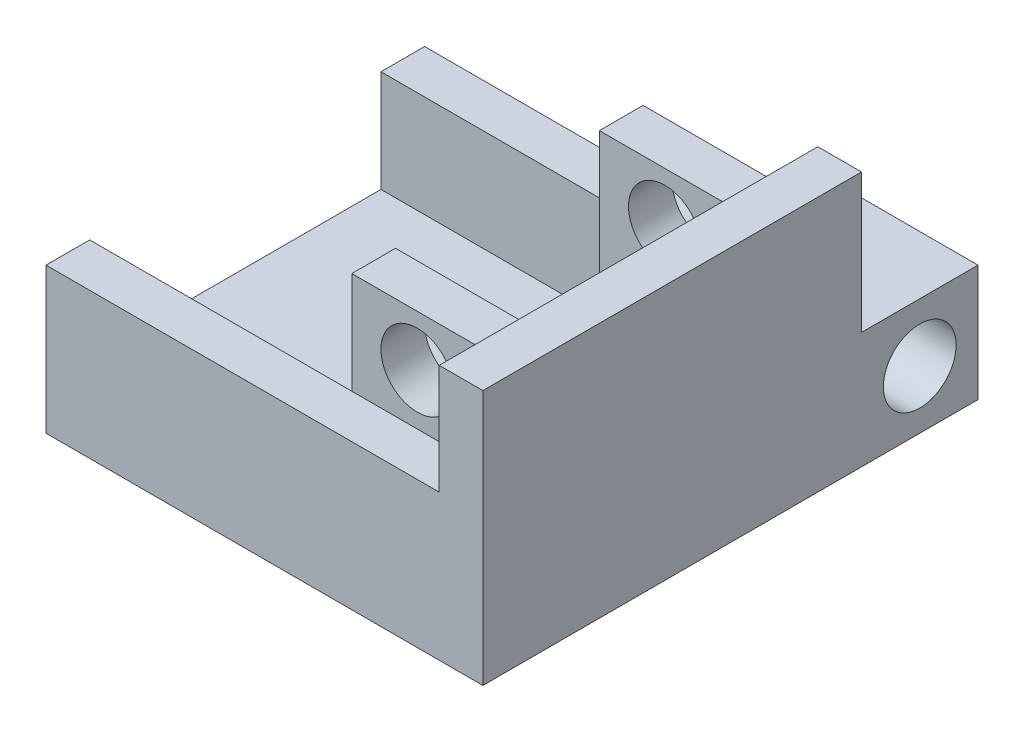
ISO-10303-21;
HEADER;
FILE_DESCRIPTION(('STEP AP214'),'2;1');
FILE_NAME('part.step','',(''),(''),'','','');
FILE_SCHEMA(('AUTOMOTIVE_DESIGN { 1 0 10303 214 1 1 1 1 }'));
ENDSEC;
DATA;
#1=APPLICATION_CONTEXT('core data for automotive mechanical design processes');
#2=APPLICATION_PROTOCOL_DEFINITION('international standard','automotive_design',2000,#1);
#3=PRODUCT_CONTEXT('',#1,'mechanical');
#4=PRODUCT('Part','Part','',(#3));
#5=PRODUCT_RELATED_PRODUCT_CATEGORY('part','',(#4));
#6=PRODUCT_DEFINITION_FORMATION('','',#4);
#7=PRODUCT_DEFINITION_CONTEXT('part definition',#1,'design');
#8=PRODUCT_DEFINITION('design','',#6,#7);
#9=PRODUCT_DEFINITION_SHAPE('','',#8);
#10=(LENGTH_UNIT() NAMED_UNIT(*) SI_UNIT(.MILLI.,.METRE.));
#11=(NAMED_UNIT(*) PLANE_ANGLE_UNIT() SI_UNIT($,.RADIAN.));
#12=(NAMED_UNIT(*) SI_UNIT($,.STERADIAN.) SOLID_ANGLE_UNIT());
#13=UNCERTAINTY_MEASURE_WITH_UNIT(LENGTH_MEASURE(1.E-05),#10,'distance_accuracy_value','');
#14=(GEOMETRIC_REPRESENTATION_CONTEXT(3) GLOBAL_UNCERTAINTY_ASSIGNED_CONTEXT((#13)) GLOBAL_UNIT_ASSIGNED_CONTEXT((#10,
#11,#12)) REPRESENTATION_CONTEXT('',''));
#15=CARTESIAN_POINT('',(0.,0.,0.));
#16=DIRECTION('',(0.,0.,1.));
#17=DIRECTION('',(1.,0.,0.));
#18=AXIS2_PLACEMENT_3D('',#15,#16,#17);
#19=CARTESIAN_POINT('',(0.,3.,-13.));
#20=DIRECTION('',(0.,0.,1.));
#21=DIRECTION('',(1.,0.,0.));
#22=AXIS2_PLACEMENT_3D('',#19,#20,#21);
#23=PLANE('',#22);
#24=DIRECTION('',(1.,0.,0.));
#25=VECTOR('',#24,1.);
#26=CARTESIAN_POINT('',(6.50000000000001,8.,-13.));
#27=LINE('',#26,#25);
#28=CARTESIAN_POINT('',(6.50000000000001,8.,-13.));
#29=VERTEX_POINT('',#28);
#30=CARTESIAN_POINT('',(16.5,8.,-13.));
#31=VERTEX_POINT('',#30);
#32=EDGE_CURVE('E254',#29,#31,#27,.T.);
#33=ORIENTED_EDGE('',*,*,#32,.F.);
#34=DIRECTION('',(0.,-1.,0.));
#35=VECTOR('',#34,1.);
#36=CARTESIAN_POINT('',(6.50000000000001,0.,-13.));
#37=LINE('',#36,#35);
#38=CARTESIAN_POINT('',(6.50000000000001,0.,-13.));
#39=VERTEX_POINT('',#38);
#40=EDGE_CURVE('E243',#29,#39,#37,.T.);
#41=ORIENTED_EDGE('',*,*,#40,.T.);
#42=DIRECTION('',(-1.,0.,0.));
#43=VECTOR('',#42,1.);
#44=CARTESIAN_POINT('',(0.,0.,-13.));
#45=LINE('',#44,#43);
#46=CARTESIAN_POINT('',(-13.5,0.,-13.));
#47=VERTEX_POINT('',#46);
#48=EDGE_CURVE('E242',#39,#47,#45,.T.);
#49=ORIENTED_EDGE('',*,*,#48,.T.);
#50=DIRECTION('',(0.,-1.,0.));
#51=VECTOR('',#50,1.);
#52=CARTESIAN_POINT('',(-13.5,36.1725046566048,-13.));
#53=LINE('',#52,#51);
#54=CARTESIAN_POINT('',(-13.5,10.,-13.));
#55=VERTEX_POINT('',#54);
#56=EDGE_CURVE('E328',#55,#47,#53,.T.);
#57=ORIENTED_EDGE('',*,*,#56,.F.);
#58=DIRECTION('',(-1.,0.,0.));
#59=VECTOR('',#58,1.);
#60=CARTESIAN_POINT('',(4.5,10.,-13.));
#61=LINE('',#60,#59);
#62=CARTESIAN_POINT('',(13.5,10.,-13.));
#63=VERTEX_POINT('',#62);
#64=EDGE_CURVE('E396',#63,#55,#61,.T.);
#65=ORIENTED_EDGE('',*,*,#64,.F.);
#66=DIRECTION('',(0.,-1.,0.));
#67=VECTOR('',#66,1.);
#68=CARTESIAN_POINT('',(13.5,17.54,-13.));
#69=LINE('',#68,#67);
#70=CARTESIAN_POINT('',(13.5,17.54,-13.));
#71=VERTEX_POINT('',#70);
#72=EDGE_CURVE('E319',#71,#63,#69,.T.);
#73=ORIENTED_EDGE('',*,*,#72,.F.);
#74=DIRECTION('',(-1.,0.,0.));
#75=VECTOR('',#74,1.);
#76=CARTESIAN_POINT('',(16.5,17.54,-13.));
#77=LINE('',#76,#75);
#78=CARTESIAN_POINT('',(16.5,17.54,-13.));
#79=VERTEX_POINT('',#78);
#80=EDGE_CURVE('E308',#79,#71,#77,.T.);
#81=ORIENTED_EDGE('',*,*,#80,.F.);
#82=DIRECTION('',(0.,-1.,0.));
#83=VECTOR('',#82,1.);
#84=CARTESIAN_POINT('',(16.5,36.1725046566048,-13.));
#85=LINE('',#84,#83);
#86=EDGE_CURVE('E352',#79,#31,#85,.T.);
#87=ORIENTED_EDGE('',*,*,#86,.T.);
#88=EDGE_LOOP('',(#33,#41,#49,#57,#65,#73,#81,#87));
#89=FACE_BOUND('',#88,.T.);
#90=ADVANCED_FACE('F35',(#89),#23,.F.);
#91=CARTESIAN_POINT('',(13.5,36.1725046566048,0.));
#92=DIRECTION('',(-1.,0.,0.));
#93=DIRECTION('',(0.,0.,1.));
#94=AXIS2_PLACEMENT_3D('',#91,#92,#93);
#95=PLANE('',#94);
#96=DIRECTION('',(0.,0.,-1.));
#97=VECTOR('',#96,1.);
#98=CARTESIAN_POINT('',(13.5,17.,7.));
#99=LINE('',#98,#97);
#100=CARTESIAN_POINT('',(13.5,17.,10.));
#101=VERTEX_POINT('',#100);
#102=CARTESIAN_POINT('',(13.5,17.,7.));
#103=VERTEX_POINT('',#102);
#104=EDGE_CURVE('E273',#101,#103,#99,.T.);
#105=ORIENTED_EDGE('',*,*,#104,.F.);
#106=DIRECTION('',(0.,-1.,0.));
#107=VECTOR('',#106,1.);
#108=CARTESIAN_POINT('',(13.5,17.,10.));
#109=LINE('',#108,#107);
#110=CARTESIAN_POINT('',(13.5,10.,10.));
#111=VERTEX_POINT('',#110);
#112=EDGE_CURVE('E278',#101,#111,#109,.T.);
#113=ORIENTED_EDGE('',*,*,#112,.T.);
#114=DIRECTION('',(0.,0.,1.));
#115=VECTOR('',#114,1.);
#116=CARTESIAN_POINT('',(13.5,10.,-13.));
#117=LINE('',#116,#115);
#118=CARTESIAN_POINT('',(13.5,10.,13.));
#119=VERTEX_POINT('',#118);
#120=EDGE_CURVE('E11',#111,#119,#117,.T.);
#121=ORIENTED_EDGE('',*,*,#120,.T.);
#122=DIRECTION('',(0.,-1.,0.));
#123=VECTOR('',#122,1.);
#124=CARTESIAN_POINT('',(13.5,17.54,13.));
#125=LINE('',#124,#123);
#126=CARTESIAN_POINT('',(13.5,17.54,13.));
#127=VERTEX_POINT('',#126);
#128=EDGE_CURVE('E314',#127,#119,#125,.T.);
#129=ORIENTED_EDGE('',*,*,#128,.F.);
#130=DIRECTION('',(0.,0.,1.));
#131=VECTOR('',#130,1.);
#132=CARTESIAN_POINT('',(13.5,17.54,-13.));
#133=LINE('',#132,#131);
#134=EDGE_CURVE('E310',#71,#127,#133,.T.);
#135=ORIENTED_EDGE('',*,*,#134,.F.);
#136=ORIENTED_EDGE('',*,*,#72,.T.);
#137=CARTESIAN_POINT('',(13.5,10.,-10.));
#138=VERTEX_POINT('',#137);
#139=EDGE_CURVE('E46',#63,#138,#117,.T.);
#140=ORIENTED_EDGE('',*,*,#139,.T.);
#141=DIRECTION('',(0.,-1.,0.));
#142=VECTOR('',#141,1.);
#143=CARTESIAN_POINT('',(13.5,17.,-10.));
#144=LINE('',#143,#142);
#145=CARTESIAN_POINT('',(13.5,17.,-10.));
#146=VERTEX_POINT('',#145);
#147=EDGE_CURVE('E302',#146,#138,#144,.T.);
#148=ORIENTED_EDGE('',*,*,#147,.F.);
#149=DIRECTION('',(0.,0.,-1.));
#150=VECTOR('',#149,1.);
#151=CARTESIAN_POINT('',(13.5,17.,-10.));
#152=LINE('',#151,#150);
#153=CARTESIAN_POINT('',(13.5,17.,-7.));
#154=VERTEX_POINT('',#153);
#155=EDGE_CURVE('E292',#154,#146,#152,.T.);
#156=ORIENTED_EDGE('',*,*,#155,.F.);
#157=DIRECTION('',(0.,-1.,0.));
#158=VECTOR('',#157,1.);
#159=CARTESIAN_POINT('',(13.5,10.,-7.));
#160=LINE('',#159,#158);
#161=CARTESIAN_POINT('',(13.5,7.,-7.));
#162=VERTEX_POINT('',#161);
#163=EDGE_CURVE('E398',#154,#162,#160,.T.);
#164=ORIENTED_EDGE('',*,*,#163,.T.);
#165=DIRECTION('',(0.,0.,-1.));
#166=VECTOR('',#165,1.);
#167=CARTESIAN_POINT('',(13.5,7.,-13.));
#168=LINE('',#167,#166);
#169=CARTESIAN_POINT('',(13.5,7.,-10.));
#170=VERTEX_POINT('',#169);
#171=EDGE_CURVE('E399',#162,#170,#168,.T.);
#172=ORIENTED_EDGE('',*,*,#171,.T.);
#173=DIRECTION('',(0.,-1.,0.));
#174=VECTOR('',#173,1.);
#175=CARTESIAN_POINT('',(13.5,7.,-10.));
#176=LINE('',#175,#174);
#177=CARTESIAN_POINT('',(13.5,5.,-10.));
#178=VERTEX_POINT('',#177);
#179=EDGE_CURVE('E427',#170,#178,#176,.T.);
#180=ORIENTED_EDGE('',*,*,#179,.T.);
#181=DIRECTION('',(0.,0.,-1.));
#182=VECTOR('',#181,1.);
#183=CARTESIAN_POINT('',(13.5,5.,0.));
#184=LINE('',#183,#182);
#185=CARTESIAN_POINT('',(13.5,5.,-7.));
#186=VERTEX_POINT('',#185);
#187=EDGE_CURVE('E364',#186,#178,#184,.T.);
#188=ORIENTED_EDGE('',*,*,#187,.F.);
#189=DIRECTION('',(0.,-1.,0.));
#190=VECTOR('',#189,1.);
#191=CARTESIAN_POINT('',(13.5,5.,-7.));
#192=LINE('',#191,#190);
#193=CARTESIAN_POINT('',(13.5,3.,-7.));
#194=VERTEX_POINT('',#193);
#195=EDGE_CURVE('E367',#186,#194,#192,.T.);
#196=ORIENTED_EDGE('',*,*,#195,.T.);
#197=DIRECTION('',(0.,0.,-1.));
#198=VECTOR('',#197,1.);
#199=CARTESIAN_POINT('',(13.5,3.,0.));
#200=LINE('',#199,#198);
#201=CARTESIAN_POINT('',(13.5,3.,7.));
#202=VERTEX_POINT('',#201);
#203=EDGE_CURVE('E440',#202,#194,#200,.T.);
#204=ORIENTED_EDGE('',*,*,#203,.F.);
#205=DIRECTION('',(0.,-1.,0.));
#206=VECTOR('',#205,1.);
#207=CARTESIAN_POINT('',(13.5,5.,7.));
#208=LINE('',#207,#206);
#209=CARTESIAN_POINT('',(13.5,5.,7.));
#210=VERTEX_POINT('',#209);
#211=EDGE_CURVE('E387',#210,#202,#208,.T.);
#212=ORIENTED_EDGE('',*,*,#211,.F.);
#213=DIRECTION('',(0.,0.,-1.));
#214=VECTOR('',#213,1.);
#215=CARTESIAN_POINT('',(13.5,5.,0.));
#216=LINE('',#215,#214);
#217=CARTESIAN_POINT('',(13.5,5.,10.));
#218=VERTEX_POINT('',#217);
#219=EDGE_CURVE('E385',#218,#210,#216,.T.);
#220=ORIENTED_EDGE('',*,*,#219,.F.);
#221=DIRECTION('',(0.,-1.,0.));
#222=VECTOR('',#221,1.);
#223=CARTESIAN_POINT('',(13.5,7.,10.));
#224=LINE('',#223,#222);
#225=CARTESIAN_POINT('',(13.5,7.,10.));
#226=VERTEX_POINT('',#225);
#227=EDGE_CURVE('E433',#226,#218,#224,.T.);
#228=ORIENTED_EDGE('',*,*,#227,.F.);
#229=DIRECTION('',(0.,0.,-1.));
#230=VECTOR('',#229,1.);
#231=CARTESIAN_POINT('',(13.5,7.,13.));
#232=LINE('',#231,#230);
#233=CARTESIAN_POINT('',(13.5,7.,7.));
#234=VERTEX_POINT('',#233);
#235=EDGE_CURVE('E418',#226,#234,#232,.T.);
#236=ORIENTED_EDGE('',*,*,#235,.T.);
#237=DIRECTION('',(0.,-1.,0.));
#238=VECTOR('',#237,1.);
#239=CARTESIAN_POINT('',(13.5,10.,7.));
#240=LINE('',#239,#238);
#241=EDGE_CURVE('E61',#103,#234,#240,.T.);
#242=ORIENTED_EDGE('',*,*,#241,.F.);
#243=EDGE_LOOP('',(#105,#113,#121,#129,#135,#136,#140,#148,#156,#164,#172,#180,#188,#196,#204,
#212,#220,#228,#236,#242));
#244=FACE_BOUND('',#243,.T.);
#245=ADVANCED_FACE('F469',(#244),#95,.T.);
#246=CARTESIAN_POINT('',(0.,10.,0.));
#247=DIRECTION('',(0.,-1.,0.));
#248=DIRECTION('',(0.,0.,-1.));
#249=AXIS2_PLACEMENT_3D('',#246,#247,#248);
#250=PLANE('',#249);
#251=DIRECTION('',(1.,0.,0.));
#252=VECTOR('',#251,1.);
#253=CARTESIAN_POINT('',(4.5,10.,10.));
#254=LINE('',#253,#252);
#255=CARTESIAN_POINT('',(4.5,10.,10.));
#256=VERTEX_POINT('',#255);
#257=EDGE_CURVE('E266',#256,#111,#254,.T.);
#258=ORIENTED_EDGE('',*,*,#257,.F.);
#259=DIRECTION('',(1.,0.,0.));
#260=VECTOR('',#259,1.);
#261=CARTESIAN_POINT('',(0.,10.,10.));
#262=LINE('',#261,#260);
#263=CARTESIAN_POINT('',(-13.5,10.,10.));
#264=VERTEX_POINT('',#263);
#265=EDGE_CURVE('E331',#264,#256,#262,.T.);
#266=ORIENTED_EDGE('',*,*,#265,.F.);
#267=DIRECTION('',(0.,0.,-1.));
#268=VECTOR('',#267,1.);
#269=CARTESIAN_POINT('',(-13.5,10.,0.));
#270=LINE('',#269,#268);
#271=CARTESIAN_POINT('',(-13.5,10.,13.));
#272=VERTEX_POINT('',#271);
#273=EDGE_CURVE('E339',#272,#264,#270,.T.);
#274=ORIENTED_EDGE('',*,*,#273,.F.);
#275=DIRECTION('',(1.,0.,0.));
#276=VECTOR('',#275,1.);
#277=CARTESIAN_POINT('',(4.5,10.,13.));
#278=LINE('',#277,#276);
#279=EDGE_CURVE('E411',#272,#119,#278,.T.);
#280=ORIENTED_EDGE('',*,*,#279,.T.);
#281=ORIENTED_EDGE('',*,*,#120,.F.);
#282=EDGE_LOOP('',(#258,#266,#274,#280,#281));
#283=FACE_BOUND('',#282,.T.);
#284=ADVANCED_FACE('F515',(#283),#250,.F.);
#285=DIRECTION('',(-1.,0.,0.));
#286=VECTOR('',#285,1.);
#287=CARTESIAN_POINT('',(4.5,10.,-10.));
#288=LINE('',#287,#286);
#289=CARTESIAN_POINT('',(4.5,10.,-10.));
#290=VERTEX_POINT('',#289);
#291=EDGE_CURVE('E285',#138,#290,#288,.T.);
#292=ORIENTED_EDGE('',*,*,#291,.F.);
#293=ORIENTED_EDGE('',*,*,#139,.F.);
#294=ORIENTED_EDGE('',*,*,#64,.T.);
#295=DIRECTION('',(0.,0.,1.));
#296=VECTOR('',#295,1.);
#297=CARTESIAN_POINT('',(-13.5,10.,0.));
#298=LINE('',#297,#296);
#299=CARTESIAN_POINT('',(-13.5,10.,-10.));
#300=VERTEX_POINT('',#299);
#301=EDGE_CURVE('E322',#55,#300,#298,.T.);
#302=ORIENTED_EDGE('',*,*,#301,.T.);
#303=DIRECTION('',(1.,0.,0.));
#304=VECTOR('',#303,1.);
#305=CARTESIAN_POINT('',(0.,10.,-10.));
#306=LINE('',#305,#304);
#307=EDGE_CURVE('E324',#300,#290,#306,.T.);
#308=ORIENTED_EDGE('',*,*,#307,.T.);
#309=EDGE_LOOP('',(#292,#293,#294,#302,#308));
#310=FACE_BOUND('',#309,.T.);
#311=ADVANCED_FACE('F484',(#310),#250,.F.);
#312=CARTESIAN_POINT('',(4.5,3.,0.));
#313=DIRECTION('',(1.,0.,0.));
#314=DIRECTION('',(0.,0.,-1.));
#315=AXIS2_PLACEMENT_3D('',#312,#313,#314);
#316=PLANE('',#315);
#317=DIRECTION('',(0.,-1.,0.));
#318=VECTOR('',#317,1.);
#319=CARTESIAN_POINT('',(4.5,36.1725046566048,-10.));
#320=LINE('',#319,#318);
#321=CARTESIAN_POINT('',(4.5,5.,-10.));
#322=VERTEX_POINT('',#321);
#323=CARTESIAN_POINT('',(4.5,3.,-10.));
#324=VERTEX_POINT('',#323);
#325=EDGE_CURVE('E327',#322,#324,#320,.T.);
#326=ORIENTED_EDGE('',*,*,#325,.T.);
#327=DIRECTION('',(0.,0.,1.));
#328=VECTOR('',#327,1.);
#329=CARTESIAN_POINT('',(4.50000000000001,3.,0.));
#330=LINE('',#329,#328);
#331=CARTESIAN_POINT('',(4.5,3.,-7.));
#332=VERTEX_POINT('',#331);
#333=EDGE_CURVE('E356',#324,#332,#330,.T.);
#334=ORIENTED_EDGE('',*,*,#333,.T.);
#335=DIRECTION('',(0.,-1.,0.));
#336=VECTOR('',#335,1.);
#337=CARTESIAN_POINT('',(4.5,5.,-7.));
#338=LINE('',#337,#336);
#339=CARTESIAN_POINT('',(4.5,5.,-7.));
#340=VERTEX_POINT('',#339);
#341=EDGE_CURVE('E374',#340,#332,#338,.T.);
#342=ORIENTED_EDGE('',*,*,#341,.F.);
#343=DIRECTION('',(0.,0.,1.));
#344=VECTOR('',#343,1.);
#345=CARTESIAN_POINT('',(4.50000000000001,5.,0.));
#346=LINE('',#345,#344);
#347=EDGE_CURVE('E359',#322,#340,#346,.T.);
#348=ORIENTED_EDGE('',*,*,#347,.F.);
#349=EDGE_LOOP('',(#326,#334,#342,#348));
#350=FACE_BOUND('',#349,.T.);
#351=ADVANCED_FACE('F462',(#350),#316,.F.);
#352=CARTESIAN_POINT('',(4.5,7.,-10.));
#353=VERTEX_POINT('',#352);
#354=EDGE_CURVE('E334',#290,#353,#320,.T.);
#355=ORIENTED_EDGE('',*,*,#354,.T.);
#356=DIRECTION('',(0.,0.,1.));
#357=VECTOR('',#356,1.);
#358=CARTESIAN_POINT('',(4.5,7.,-13.));
#359=LINE('',#358,#357);
#360=CARTESIAN_POINT('',(4.5,7.,-7.));
#361=VERTEX_POINT('',#360);
#362=EDGE_CURVE('E395',#353,#361,#359,.T.);
#363=ORIENTED_EDGE('',*,*,#362,.T.);
#364=DIRECTION('',(0.,-1.,0.));
#365=VECTOR('',#364,1.);
#366=CARTESIAN_POINT('',(4.5,10.,-7.));
#367=LINE('',#366,#365);
#368=CARTESIAN_POINT('',(4.5,17.,-7.));
#369=VERTEX_POINT('',#368);
#370=EDGE_CURVE('E407',#369,#361,#367,.T.);
#371=ORIENTED_EDGE('',*,*,#370,.F.);
#372=DIRECTION('',(0.,0.,1.));
#373=VECTOR('',#372,1.);
#374=CARTESIAN_POINT('',(4.5,17.,-10.));
#375=LINE('',#374,#373);
#376=CARTESIAN_POINT('',(4.5,17.,-10.));
#377=VERTEX_POINT('',#376);
#378=EDGE_CURVE('E286',#377,#369,#375,.T.);
#379=ORIENTED_EDGE('',*,*,#378,.F.);
#380=DIRECTION('',(0.,-1.,0.));
#381=VECTOR('',#380,1.);
#382=CARTESIAN_POINT('',(4.5,17.,-10.));
#383=LINE('',#382,#381);
#384=EDGE_CURVE('E297',#377,#290,#383,.T.);
#385=ORIENTED_EDGE('',*,*,#384,.T.);
#386=EDGE_LOOP('',(#355,#363,#371,#379,#385));
#387=FACE_BOUND('',#386,.T.);
#388=ADVANCED_FACE('F478',(#387),#316,.F.);
#389=CARTESIAN_POINT('',(4.50000000000001,3.,0.));
#390=DIRECTION('',(-1.,0.,0.));
#391=DIRECTION('',(0.,0.,1.));
#392=AXIS2_PLACEMENT_3D('',#389,#390,#391);
#393=PLANE('',#392);
#394=DIRECTION('',(0.,-1.,0.));
#395=VECTOR('',#394,1.);
#396=CARTESIAN_POINT('',(4.5,36.1725046566048,10.));
#397=LINE('',#396,#395);
#398=CARTESIAN_POINT('',(4.5,7.,10.));
#399=VERTEX_POINT('',#398);
#400=EDGE_CURVE('E346',#256,#399,#397,.T.);
#401=ORIENTED_EDGE('',*,*,#400,.F.);
#402=DIRECTION('',(0.,-1.,0.));
#403=VECTOR('',#402,1.);
#404=CARTESIAN_POINT('',(4.5,17.,10.));
#405=LINE('',#404,#403);
#406=CARTESIAN_POINT('',(4.5,17.,10.));
#407=VERTEX_POINT('',#406);
#408=EDGE_CURVE('E282',#407,#256,#405,.T.);
#409=ORIENTED_EDGE('',*,*,#408,.F.);
#410=DIRECTION('',(0.,0.,1.));
#411=VECTOR('',#410,1.);
#412=CARTESIAN_POINT('',(4.5,17.,7.));
#413=LINE('',#412,#411);
#414=CARTESIAN_POINT('',(4.5,17.,7.));
#415=VERTEX_POINT('',#414);
#416=EDGE_CURVE('E267',#415,#407,#413,.T.);
#417=ORIENTED_EDGE('',*,*,#416,.F.);
#418=DIRECTION('',(0.,-1.,0.));
#419=VECTOR('',#418,1.);
#420=CARTESIAN_POINT('',(4.5,10.,7.));
#421=LINE('',#420,#419);
#422=CARTESIAN_POINT('',(4.5,7.,7.));
#423=VERTEX_POINT('',#422);
#424=EDGE_CURVE('E414',#415,#423,#421,.T.);
#425=ORIENTED_EDGE('',*,*,#424,.T.);
#426=DIRECTION('',(0.,0.,1.));
#427=VECTOR('',#426,1.);
#428=CARTESIAN_POINT('',(4.5,7.,13.));
#429=LINE('',#428,#427);
#430=EDGE_CURVE('E410',#423,#399,#429,.T.);
#431=ORIENTED_EDGE('',*,*,#430,.T.);
#432=EDGE_LOOP('',(#401,#409,#417,#425,#431));
#433=FACE_BOUND('',#432,.T.);
#434=ADVANCED_FACE('F531',(#433),#393,.T.);
#435=CARTESIAN_POINT('',(0.,3.,0.));
#436=DIRECTION('',(0.,1.,0.));
#437=DIRECTION('',(0.,0.,1.));
#438=AXIS2_PLACEMENT_3D('',#435,#436,#437);
#439=PLANE('',#438);
#440=DIRECTION('',(1.,0.,0.));
#441=VECTOR('',#440,1.);
#442=CARTESIAN_POINT('',(0.,3.,-7.));
#443=LINE('',#442,#441);
#444=EDGE_CURVE('E362',#332,#194,#443,.T.);
#445=ORIENTED_EDGE('',*,*,#444,.F.);
#446=ORIENTED_EDGE('',*,*,#333,.F.);
#447=DIRECTION('',(1.,0.,0.));
#448=VECTOR('',#447,1.);
#449=CARTESIAN_POINT('',(0.,3.,-10.));
#450=LINE('',#449,#448);
#451=CARTESIAN_POINT('',(-13.5,3.,-10.));
#452=VERTEX_POINT('',#451);
#453=EDGE_CURVE('E443',#452,#324,#450,.T.);
#454=ORIENTED_EDGE('',*,*,#453,.F.);
#455=DIRECTION('',(0.,0.,-1.));
#456=VECTOR('',#455,1.);
#457=CARTESIAN_POINT('',(-13.5,3.,0.));
#458=LINE('',#457,#456);
#459=CARTESIAN_POINT('',(-13.5,3.,10.));
#460=VERTEX_POINT('',#459);
#461=EDGE_CURVE('E445',#460,#452,#458,.T.);
#462=ORIENTED_EDGE('',*,*,#461,.F.);
#463=DIRECTION('',(1.,0.,0.));
#464=VECTOR('',#463,1.);
#465=CARTESIAN_POINT('',(0.,3.,10.));
#466=LINE('',#465,#464);
#467=CARTESIAN_POINT('',(4.5,3.,10.));
#468=VERTEX_POINT('',#467);
#469=EDGE_CURVE('E437',#460,#468,#466,.T.);
#470=ORIENTED_EDGE('',*,*,#469,.T.);
#471=DIRECTION('',(0.,0.,1.));
#472=VECTOR('',#471,1.);
#473=CARTESIAN_POINT('',(4.5,3.,0.));
#474=LINE('',#473,#472);
#475=CARTESIAN_POINT('',(4.5,3.,7.));
#476=VERTEX_POINT('',#475);
#477=EDGE_CURVE('E382',#476,#468,#474,.T.);
#478=ORIENTED_EDGE('',*,*,#477,.F.);
#479=DIRECTION('',(-1.,0.,0.));
#480=VECTOR('',#479,1.);
#481=CARTESIAN_POINT('',(0.,3.,7.));
#482=LINE('',#481,#480);
#483=EDGE_CURVE('E377',#202,#476,#482,.T.);
#484=ORIENTED_EDGE('',*,*,#483,.F.);
#485=ORIENTED_EDGE('',*,*,#203,.T.);
#486=EDGE_LOOP('',(#445,#446,#454,#462,#470,#478,#484,#485));
#487=FACE_BOUND('',#486,.T.);
#488=ADVANCED_FACE('F529',(#487),#439,.T.);
#489=CARTESIAN_POINT('',(4.5,5.,10.));
#490=VERTEX_POINT('',#489);
#491=EDGE_CURVE('E338',#490,#468,#397,.T.);
#492=ORIENTED_EDGE('',*,*,#491,.F.);
#493=DIRECTION('',(0.,0.,1.));
#494=VECTOR('',#493,1.);
#495=CARTESIAN_POINT('',(4.5,5.,0.));
#496=LINE('',#495,#494);
#497=CARTESIAN_POINT('',(4.5,5.,7.));
#498=VERTEX_POINT('',#497);
#499=EDGE_CURVE('E381',#498,#490,#496,.T.);
#500=ORIENTED_EDGE('',*,*,#499,.F.);
#501=DIRECTION('',(0.,-1.,0.));
#502=VECTOR('',#501,1.);
#503=CARTESIAN_POINT('',(4.5,5.,7.));
#504=LINE('',#503,#502);
#505=EDGE_CURVE('E393',#498,#476,#504,.T.);
#506=ORIENTED_EDGE('',*,*,#505,.T.);
#507=ORIENTED_EDGE('',*,*,#477,.T.);
#508=EDGE_LOOP('',(#492,#500,#506,#507));
#509=FACE_BOUND('',#508,.T.);
#510=ADVANCED_FACE('F37',(#509),#393,.T.);
#511=CARTESIAN_POINT('',(0.,3.,13.));
#512=DIRECTION('',(0.,0.,1.));
#513=DIRECTION('',(1.,0.,0.));
#514=AXIS2_PLACEMENT_3D('',#511,#512,#513);
#515=PLANE('',#514);
#516=ORIENTED_EDGE('',*,*,#279,.F.);
#517=DIRECTION('',(0.,-1.,0.));
#518=VECTOR('',#517,1.);
#519=CARTESIAN_POINT('',(-13.5,36.1725046566048,13.));
#520=LINE('',#519,#518);
#521=CARTESIAN_POINT('',(-13.5,0.,13.));
#522=VERTEX_POINT('',#521);
#523=EDGE_CURVE('E343',#272,#522,#520,.T.);
#524=ORIENTED_EDGE('',*,*,#523,.T.);
#525=DIRECTION('',(-1.,0.,0.));
#526=VECTOR('',#525,1.);
#527=CARTESIAN_POINT('',(0.,0.,13.));
#528=LINE('',#527,#526);
#529=CARTESIAN_POINT('',(16.5,0.,13.));
#530=VERTEX_POINT('',#529);
#531=EDGE_CURVE('E436',#530,#522,#528,.T.);
#532=ORIENTED_EDGE('',*,*,#531,.F.);
#533=DIRECTION('',(0.,-1.,0.));
#534=VECTOR('',#533,1.);
#535=CARTESIAN_POINT('',(16.5,36.1725046566048,13.));
#536=LINE('',#535,#534);
#537=CARTESIAN_POINT('',(16.5,17.54,13.));
#538=VERTEX_POINT('',#537);
#539=EDGE_CURVE('E353',#538,#530,#536,.T.);
#540=ORIENTED_EDGE('',*,*,#539,.F.);
#541=DIRECTION('',(1.,0.,0.));
#542=VECTOR('',#541,1.);
#543=CARTESIAN_POINT('',(16.5,17.54,13.));
#544=LINE('',#543,#542);
#545=EDGE_CURVE('E312',#127,#538,#544,.T.);
#546=ORIENTED_EDGE('',*,*,#545,.F.);
#547=ORIENTED_EDGE('',*,*,#128,.T.);
#548=EDGE_LOOP('',(#516,#524,#532,#540,#546,#547));
#549=FACE_BOUND('',#548,.T.);
#550=ADVANCED_FACE('F520',(#549),#515,.T.);
#551=CARTESIAN_POINT('',(-13.5,3.,0.));
#552=DIRECTION('',(-1.,0.,0.));
#553=DIRECTION('',(0.,0.,1.));
#554=AXIS2_PLACEMENT_3D('',#551,#552,#553);
#555=PLANE('',#554);
#556=DIRECTION('',(0.,0.,-1.));
#557=VECTOR('',#556,1.);
#558=CARTESIAN_POINT('',(-13.5,0.,0.));
#559=LINE('',#558,#557);
#560=EDGE_CURVE('E441',#522,#47,#559,.T.);
#561=ORIENTED_EDGE('',*,*,#560,.F.);
#562=ORIENTED_EDGE('',*,*,#523,.F.);
#563=ORIENTED_EDGE('',*,*,#273,.T.);
#564=DIRECTION('',(0.,-1.,0.));
#565=VECTOR('',#564,1.);
#566=CARTESIAN_POINT('',(-13.5,36.1725046566048,10.));
#567=LINE('',#566,#565);
#568=EDGE_CURVE('E342',#264,#460,#567,.T.);
#569=ORIENTED_EDGE('',*,*,#568,.T.);
#570=ORIENTED_EDGE('',*,*,#461,.T.);
#571=DIRECTION('',(0.,-1.,0.));
#572=VECTOR('',#571,1.);
#573=CARTESIAN_POINT('',(-13.5,36.1725046566048,-10.));
#574=LINE('',#573,#572);
#575=EDGE_CURVE('E332',#300,#452,#574,.T.);
#576=ORIENTED_EDGE('',*,*,#575,.F.);
#577=ORIENTED_EDGE('',*,*,#301,.F.);
#578=ORIENTED_EDGE('',*,*,#56,.T.);
#579=EDGE_LOOP('',(#561,#562,#563,#569,#570,#576,#577,#578));
#580=FACE_BOUND('',#579,.T.);
#581=ADVANCED_FACE('F522',(#580),#555,.T.);
#582=CARTESIAN_POINT('',(0.,0.,0.));
#583=DIRECTION('',(0.,1.,0.));
#584=DIRECTION('',(0.,0.,1.));
#585=AXIS2_PLACEMENT_3D('',#582,#583,#584);
#586=PLANE('',#585);
#587=ORIENTED_EDGE('',*,*,#531,.T.);
#588=ORIENTED_EDGE('',*,*,#560,.T.);
#589=ORIENTED_EDGE('',*,*,#48,.F.);
#590=DIRECTION('',(0.,0.,-1.));
#591=VECTOR('',#590,1.);
#592=CARTESIAN_POINT('',(6.50000000000001,0.,-13.));
#593=LINE('',#592,#591);
#594=CARTESIAN_POINT('',(6.5,0.,-21.));
#595=VERTEX_POINT('',#594);
#596=EDGE_CURVE('E53',#39,#595,#593,.T.);
#597=ORIENTED_EDGE('',*,*,#596,.T.);
#598=DIRECTION('',(1.,0.,0.));
#599=VECTOR('',#598,1.);
#600=CARTESIAN_POINT('',(6.5,0.,-21.));
#601=LINE('',#600,#599);
#602=CARTESIAN_POINT('',(16.5,0.,-21.));
#603=VERTEX_POINT('',#602);
#604=EDGE_CURVE('E224',#595,#603,#601,.T.);
#605=ORIENTED_EDGE('',*,*,#604,.T.);
#606=DIRECTION('',(0.,0.,1.));
#607=VECTOR('',#606,1.);
#608=CARTESIAN_POINT('',(16.5,0.,0.));
#609=LINE('',#608,#607);
#610=EDGE_CURVE('E350',#603,#530,#609,.T.);
#611=ORIENTED_EDGE('',*,*,#610,.T.);
#612=EDGE_LOOP('',(#587,#588,#589,#597,#605,#611));
#613=FACE_BOUND('',#612,.T.);
#614=ADVANCED_FACE('F240',(#613),#586,.F.);
#615=CARTESIAN_POINT('',(0.,7.,10.));
#616=DIRECTION('',(0.,0.,1.));
#617=DIRECTION('',(1.,0.,0.));
#618=AXIS2_PLACEMENT_3D('',#615,#616,#617);
#619=PLANE('',#618);
#620=ORIENTED_EDGE('',*,*,#227,.T.);
#621=DIRECTION('',(-1.,0.,0.));
#622=VECTOR('',#621,1.);
#623=CARTESIAN_POINT('',(0.,5.,10.));
#624=LINE('',#623,#622);
#625=EDGE_CURVE('E448',#218,#490,#624,.T.);
#626=ORIENTED_EDGE('',*,*,#625,.T.);
#627=ORIENTED_EDGE('',*,*,#491,.T.);
#628=ORIENTED_EDGE('',*,*,#469,.F.);
#629=ORIENTED_EDGE('',*,*,#568,.F.);
#630=ORIENTED_EDGE('',*,*,#265,.T.);
#631=ORIENTED_EDGE('',*,*,#400,.T.);
#632=DIRECTION('',(-1.,0.,0.));
#633=VECTOR('',#632,1.);
#634=CARTESIAN_POINT('',(0.,7.,10.));
#635=LINE('',#634,#633);
#636=EDGE_CURVE('E430',#226,#399,#635,.T.);
#637=ORIENTED_EDGE('',*,*,#636,.F.);
#638=EDGE_LOOP('',(#620,#626,#627,#628,#629,#630,#631,#637));
#639=FACE_BOUND('',#638,.T.);
#640=ADVANCED_FACE('F558',(#639),#619,.F.);
#641=CARTESIAN_POINT('',(0.,7.,-10.));
#642=DIRECTION('',(0.,0.,1.));
#643=DIRECTION('',(1.,0.,0.));
#644=AXIS2_PLACEMENT_3D('',#641,#642,#643);
#645=PLANE('',#644);
#646=DIRECTION('',(-1.,0.,0.));
#647=VECTOR('',#646,1.);
#648=CARTESIAN_POINT('',(0.,5.,-10.));
#649=LINE('',#648,#647);
#650=EDGE_CURVE('E44',#178,#322,#649,.T.);
#651=ORIENTED_EDGE('',*,*,#650,.F.);
#652=ORIENTED_EDGE('',*,*,#179,.F.);
#653=DIRECTION('',(-1.,0.,0.));
#654=VECTOR('',#653,1.);
#655=CARTESIAN_POINT('',(0.,7.,-10.));
#656=LINE('',#655,#654);
#657=EDGE_CURVE('E424',#170,#353,#656,.T.);
#658=ORIENTED_EDGE('',*,*,#657,.T.);
#659=ORIENTED_EDGE('',*,*,#354,.F.);
#660=ORIENTED_EDGE('',*,*,#307,.F.);
#661=ORIENTED_EDGE('',*,*,#575,.T.);
#662=ORIENTED_EDGE('',*,*,#453,.T.);
#663=ORIENTED_EDGE('',*,*,#325,.F.);
#664=EDGE_LOOP('',(#651,#652,#658,#659,#660,#661,#662,#663));
#665=FACE_BOUND('',#664,.T.);
#666=ADVANCED_FACE('F472',(#665),#645,.T.);
#667=CARTESIAN_POINT('',(0.,7.,0.));
#668=DIRECTION('',(0.,-1.,0.));
#669=DIRECTION('',(0.,0.,-1.));
#670=AXIS2_PLACEMENT_3D('',#667,#668,#669);
#671=PLANE('',#670);
#672=ORIENTED_EDGE('',*,*,#636,.T.);
#673=ORIENTED_EDGE('',*,*,#430,.F.);
#674=DIRECTION('',(-1.,0.,0.));
#675=VECTOR('',#674,1.);
#676=CARTESIAN_POINT('',(4.5,7.,7.));
#677=LINE('',#676,#675);
#678=EDGE_CURVE('E415',#234,#423,#677,.T.);
#679=ORIENTED_EDGE('',*,*,#678,.F.);
#680=ORIENTED_EDGE('',*,*,#235,.F.);
#681=EDGE_LOOP('',(#672,#673,#679,#680));
#682=FACE_BOUND('',#681,.T.);
#683=ADVANCED_FACE('F505',(#682),#671,.T.);
#684=CARTESIAN_POINT('',(4.5,10.,7.));
#685=DIRECTION('',(0.,0.,1.));
#686=DIRECTION('',(1.,0.,0.));
#687=AXIS2_PLACEMENT_3D('',#684,#685,#686);
#688=PLANE('',#687);
#689=CARTESIAN_POINT('',(9.00000000000001,13.5,7.));
#690=DIRECTION('',(0.,0.,1.));
#691=DIRECTION('',(1.,0.,0.));
#692=AXIS2_PLACEMENT_3D('',#689,#690,#691);
#693=CIRCLE('',#692,2.5);
#694=CARTESIAN_POINT('',(11.5,13.5,7.));
#695=VERTEX_POINT('',#694);
#696=EDGE_CURVE('E263',#695,#695,#693,.T.);
#697=ORIENTED_EDGE('',*,*,#696,.T.);
#698=EDGE_LOOP('',(#697));
#699=FACE_BOUND('',#698,.T.);
#700=ORIENTED_EDGE('',*,*,#678,.T.);
#701=ORIENTED_EDGE('',*,*,#424,.F.);
#702=DIRECTION('',(-1.,0.,0.));
#703=VECTOR('',#702,1.);
#704=CARTESIAN_POINT('',(4.5,17.,7.));
#705=LINE('',#704,#703);
#706=EDGE_CURVE('E275',#103,#415,#705,.T.);
#707=ORIENTED_EDGE('',*,*,#706,.F.);
#708=ORIENTED_EDGE('',*,*,#241,.T.);
#709=EDGE_LOOP('',(#700,#701,#707,#708));
#710=FACE_BOUND('',#709,.T.);
#711=ADVANCED_FACE('F496',(#699,#710),#688,.F.);
#712=CARTESIAN_POINT('',(4.5,10.,-7.));
#713=DIRECTION('',(0.,0.,-1.));
#714=DIRECTION('',(-1.,0.,0.));
#715=AXIS2_PLACEMENT_3D('',#712,#713,#714);
#716=PLANE('',#715);
#717=CARTESIAN_POINT('',(9.00000000000001,13.5,-7.));
#718=DIRECTION('',(0.,0.,-1.));
#719=DIRECTION('',(-1.,0.,0.));
#720=AXIS2_PLACEMENT_3D('',#717,#718,#719);
#721=CIRCLE('',#720,2.5);
#722=CARTESIAN_POINT('',(6.50000000000001,13.5,-7.));
#723=VERTEX_POINT('',#722);
#724=EDGE_CURVE('E260',#723,#723,#721,.T.);
#725=ORIENTED_EDGE('',*,*,#724,.T.);
#726=EDGE_LOOP('',(#725));
#727=FACE_BOUND('',#726,.T.);
#728=DIRECTION('',(1.,0.,0.));
#729=VECTOR('',#728,1.);
#730=CARTESIAN_POINT('',(4.5,7.,-7.));
#731=LINE('',#730,#729);
#732=EDGE_CURVE('E401',#361,#162,#731,.T.);
#733=ORIENTED_EDGE('',*,*,#732,.T.);
#734=ORIENTED_EDGE('',*,*,#163,.F.);
#735=DIRECTION('',(1.,0.,0.));
#736=VECTOR('',#735,1.);
#737=CARTESIAN_POINT('',(4.5,17.,-7.));
#738=LINE('',#737,#736);
#739=EDGE_CURVE('E289',#369,#154,#738,.T.);
#740=ORIENTED_EDGE('',*,*,#739,.F.);
#741=ORIENTED_EDGE('',*,*,#370,.T.);
#742=EDGE_LOOP('',(#733,#734,#740,#741));
#743=FACE_BOUND('',#742,.T.);
#744=ADVANCED_FACE('F494',(#727,#743),#716,.F.);
#745=CARTESIAN_POINT('',(0.,7.,0.));
#746=DIRECTION('',(0.,1.,0.));
#747=DIRECTION('',(0.,0.,1.));
#748=AXIS2_PLACEMENT_3D('',#745,#746,#747);
#749=PLANE('',#748);
#750=ORIENTED_EDGE('',*,*,#657,.F.);
#751=ORIENTED_EDGE('',*,*,#171,.F.);
#752=ORIENTED_EDGE('',*,*,#732,.F.);
#753=ORIENTED_EDGE('',*,*,#362,.F.);
#754=EDGE_LOOP('',(#750,#751,#752,#753));
#755=FACE_BOUND('',#754,.T.);
#756=ADVANCED_FACE('F475',(#755),#749,.F.);
#757=CARTESIAN_POINT('',(0.,5.,0.));
#758=DIRECTION('',(0.,1.,0.));
#759=DIRECTION('',(0.,0.,1.));
#760=AXIS2_PLACEMENT_3D('',#757,#758,#759);
#761=PLANE('',#760);
#762=ORIENTED_EDGE('',*,*,#625,.F.);
#763=ORIENTED_EDGE('',*,*,#219,.T.);
#764=DIRECTION('',(-1.,0.,0.));
#765=VECTOR('',#764,1.);
#766=CARTESIAN_POINT('',(0.,5.,7.));
#767=LINE('',#766,#765);
#768=EDGE_CURVE('E378',#210,#498,#767,.T.);
#769=ORIENTED_EDGE('',*,*,#768,.T.);
#770=ORIENTED_EDGE('',*,*,#499,.T.);
#771=EDGE_LOOP('',(#762,#763,#769,#770));
#772=FACE_BOUND('',#771,.T.);
#773=ADVANCED_FACE('F503',(#772),#761,.T.);
#774=CARTESIAN_POINT('',(0.,5.,7.));
#775=DIRECTION('',(0.,0.,1.));
#776=DIRECTION('',(1.,0.,0.));
#777=AXIS2_PLACEMENT_3D('',#774,#775,#776);
#778=PLANE('',#777);
#779=ORIENTED_EDGE('',*,*,#483,.T.);
#780=ORIENTED_EDGE('',*,*,#505,.F.);
#781=ORIENTED_EDGE('',*,*,#768,.F.);
#782=ORIENTED_EDGE('',*,*,#211,.T.);
#783=EDGE_LOOP('',(#779,#780,#781,#782));
#784=FACE_BOUND('',#783,.T.);
#785=ADVANCED_FACE('F574',(#784),#778,.F.);
#786=CARTESIAN_POINT('',(0.,5.,-7.));
#787=DIRECTION('',(0.,0.,-1.));
#788=DIRECTION('',(-1.,0.,0.));
#789=AXIS2_PLACEMENT_3D('',#786,#787,#788);
#790=PLANE('',#789);
#791=ORIENTED_EDGE('',*,*,#444,.T.);
#792=ORIENTED_EDGE('',*,*,#195,.F.);
#793=DIRECTION('',(1.,0.,0.));
#794=VECTOR('',#793,1.);
#795=CARTESIAN_POINT('',(0.,5.,-7.));
#796=LINE('',#795,#794);
#797=EDGE_CURVE('E361',#340,#186,#796,.T.);
#798=ORIENTED_EDGE('',*,*,#797,.F.);
#799=ORIENTED_EDGE('',*,*,#341,.T.);
#800=EDGE_LOOP('',(#791,#792,#798,#799));
#801=FACE_BOUND('',#800,.T.);
#802=ADVANCED_FACE('F467',(#801),#790,.F.);
#803=CARTESIAN_POINT('',(0.,5.,0.));
#804=DIRECTION('',(0.,1.,0.));
#805=DIRECTION('',(0.,0.,1.));
#806=AXIS2_PLACEMENT_3D('',#803,#804,#805);
#807=PLANE('',#806);
#808=ORIENTED_EDGE('',*,*,#187,.T.);
#809=ORIENTED_EDGE('',*,*,#650,.T.);
#810=ORIENTED_EDGE('',*,*,#347,.T.);
#811=ORIENTED_EDGE('',*,*,#797,.T.);
#812=EDGE_LOOP('',(#808,#809,#810,#811));
#813=FACE_BOUND('',#812,.T.);
#814=ADVANCED_FACE('F456',(#813),#807,.T.);
#815=CARTESIAN_POINT('',(16.5,36.1725046566048,0.));
#816=DIRECTION('',(1.,0.,0.));
#817=DIRECTION('',(0.,0.,-1.));
#818=AXIS2_PLACEMENT_3D('',#815,#816,#817);
#819=PLANE('',#818);
#820=ORIENTED_EDGE('',*,*,#86,.F.);
#821=DIRECTION('',(0.,0.,-1.));
#822=VECTOR('',#821,1.);
#823=CARTESIAN_POINT('',(16.5,17.54,-13.));
#824=LINE('',#823,#822);
#825=EDGE_CURVE('E305',#538,#79,#824,.T.);
#826=ORIENTED_EDGE('',*,*,#825,.F.);
#827=ORIENTED_EDGE('',*,*,#539,.T.);
#828=ORIENTED_EDGE('',*,*,#610,.F.);
#829=DIRECTION('',(0.,1.,0.));
#830=VECTOR('',#829,1.);
#831=CARTESIAN_POINT('',(16.5,0.,-21.));
#832=LINE('',#831,#830);
#833=CARTESIAN_POINT('',(16.5,8.,-21.));
#834=VERTEX_POINT('',#833);
#835=EDGE_CURVE('E229',#603,#834,#832,.T.);
#836=ORIENTED_EDGE('',*,*,#835,.T.);
#837=DIRECTION('',(0.,0.,1.));
#838=VECTOR('',#837,1.);
#839=CARTESIAN_POINT('',(16.5,8.,-13.));
#840=LINE('',#839,#838);
#841=EDGE_CURVE('E245',#834,#31,#840,.T.);
#842=ORIENTED_EDGE('',*,*,#841,.T.);
#843=EDGE_LOOP('',(#820,#826,#827,#828,#836,#842));
#844=FACE_BOUND('',#843,.T.);
#845=CARTESIAN_POINT('',(16.5,4.,-17.));
#846=DIRECTION('',(1.,0.,0.));
#847=DIRECTION('',(0.,0.,-1.));
#848=AXIS2_PLACEMENT_3D('',#845,#846,#847);
#849=CIRCLE('',#848,2.5);
#850=CARTESIAN_POINT('',(16.5,4.,-19.5));
#851=VERTEX_POINT('',#850);
#852=EDGE_CURVE('E626',#851,#851,#849,.T.);
#853=ORIENTED_EDGE('',*,*,#852,.F.);
#854=EDGE_LOOP('',(#853));
#855=FACE_BOUND('',#854,.T.);
#856=ADVANCED_FACE('F542',(#844,#855),#819,.T.);
#857=CARTESIAN_POINT('',(0.,17.54,0.));
#858=DIRECTION('',(0.,-1.,0.));
#859=DIRECTION('',(0.,0.,-1.));
#860=AXIS2_PLACEMENT_3D('',#857,#858,#859);
#861=PLANE('',#860);
#862=ORIENTED_EDGE('',*,*,#825,.T.);
#863=ORIENTED_EDGE('',*,*,#80,.T.);
#864=ORIENTED_EDGE('',*,*,#134,.T.);
#865=ORIENTED_EDGE('',*,*,#545,.T.);
#866=EDGE_LOOP('',(#862,#863,#864,#865));
#867=FACE_BOUND('',#866,.T.);
#868=ADVANCED_FACE('F546',(#867),#861,.F.);
#869=CARTESIAN_POINT('',(4.5,17.,-10.));
#870=DIRECTION('',(0.,0.,1.));
#871=DIRECTION('',(1.,0.,0.));
#872=AXIS2_PLACEMENT_3D('',#869,#870,#871);
#873=PLANE('',#872);
#874=CARTESIAN_POINT('',(9.00000000000001,13.5,-10.));
#875=DIRECTION('',(0.,0.,1.));
#876=DIRECTION('',(1.,0.,0.));
#877=AXIS2_PLACEMENT_3D('',#874,#875,#876);
#878=CIRCLE('',#877,2.5);
#879=CARTESIAN_POINT('',(11.5,13.5,-10.));
#880=VERTEX_POINT('',#879);
#881=EDGE_CURVE('E257',#880,#880,#878,.T.);
#882=ORIENTED_EDGE('',*,*,#881,.T.);
#883=EDGE_LOOP('',(#882));
#884=FACE_BOUND('',#883,.T.);
#885=ORIENTED_EDGE('',*,*,#291,.T.);
#886=ORIENTED_EDGE('',*,*,#384,.F.);
#887=DIRECTION('',(-1.,0.,0.));
#888=VECTOR('',#887,1.);
#889=CARTESIAN_POINT('',(4.5,17.,-10.));
#890=LINE('',#889,#888);
#891=EDGE_CURVE('E295',#146,#377,#890,.T.);
#892=ORIENTED_EDGE('',*,*,#891,.F.);
#893=ORIENTED_EDGE('',*,*,#147,.T.);
#894=EDGE_LOOP('',(#885,#886,#892,#893));
#895=FACE_BOUND('',#894,.T.);
#896=ADVANCED_FACE('F488',(#884,#895),#873,.F.);
#897=CARTESIAN_POINT('',(0.,17.,0.));
#898=DIRECTION('',(0.,1.,0.));
#899=DIRECTION('',(0.,0.,1.));
#900=AXIS2_PLACEMENT_3D('',#897,#898,#899);
#901=PLANE('',#900);
#902=ORIENTED_EDGE('',*,*,#378,.T.);
#903=ORIENTED_EDGE('',*,*,#739,.T.);
#904=ORIENTED_EDGE('',*,*,#155,.T.);
#905=ORIENTED_EDGE('',*,*,#891,.T.);
#906=EDGE_LOOP('',(#902,#903,#904,#905));
#907=FACE_BOUND('',#906,.T.);
#908=ADVANCED_FACE('F492',(#907),#901,.T.);
#909=CARTESIAN_POINT('',(4.5,17.,10.));
#910=DIRECTION('',(0.,0.,-1.));
#911=DIRECTION('',(-1.,0.,0.));
#912=AXIS2_PLACEMENT_3D('',#909,#910,#911);
#913=PLANE('',#912);
#914=CARTESIAN_POINT('',(9.00000000000001,13.5,10.));
#915=DIRECTION('',(0.,0.,-1.));
#916=DIRECTION('',(-1.,0.,0.));
#917=AXIS2_PLACEMENT_3D('',#914,#915,#916);
#918=CIRCLE('',#917,2.5);
#919=CARTESIAN_POINT('',(6.50000000000001,13.5,10.));
#920=VERTEX_POINT('',#919);
#921=EDGE_CURVE('E39',#920,#920,#918,.T.);
#922=ORIENTED_EDGE('',*,*,#921,.T.);
#923=EDGE_LOOP('',(#922));
#924=FACE_BOUND('',#923,.T.);
#925=ORIENTED_EDGE('',*,*,#257,.T.);
#926=ORIENTED_EDGE('',*,*,#112,.F.);
#927=DIRECTION('',(1.,0.,0.));
#928=VECTOR('',#927,1.);
#929=CARTESIAN_POINT('',(4.5,17.,10.));
#930=LINE('',#929,#928);
#931=EDGE_CURVE('E270',#407,#101,#930,.T.);
#932=ORIENTED_EDGE('',*,*,#931,.F.);
#933=ORIENTED_EDGE('',*,*,#408,.T.);
#934=EDGE_LOOP('',(#925,#926,#932,#933));
#935=FACE_BOUND('',#934,.T.);
#936=ADVANCED_FACE('F551',(#924,#935),#913,.F.);
#937=CARTESIAN_POINT('',(0.,17.,0.));
#938=DIRECTION('',(0.,1.,0.));
#939=DIRECTION('',(0.,0.,1.));
#940=AXIS2_PLACEMENT_3D('',#937,#938,#939);
#941=PLANE('',#940);
#942=ORIENTED_EDGE('',*,*,#416,.T.);
#943=ORIENTED_EDGE('',*,*,#931,.T.);
#944=ORIENTED_EDGE('',*,*,#104,.T.);
#945=ORIENTED_EDGE('',*,*,#706,.T.);
#946=EDGE_LOOP('',(#942,#943,#944,#945));
#947=FACE_BOUND('',#946,.T.);
#948=ADVANCED_FACE('F597',(#947),#941,.T.);
#949=CARTESIAN_POINT('',(9.00000000000001,13.5,-13.));
#950=DIRECTION('',(0.,0.,1.));
#951=DIRECTION('',(1.,0.,0.));
#952=AXIS2_PLACEMENT_3D('',#949,#950,#951);
#953=CYLINDRICAL_SURFACE('',#952,2.5);
#954=ORIENTED_EDGE('',*,*,#921,.F.);
#955=EDGE_LOOP('',(#954));
#956=FACE_BOUND('',#955,.T.);
#957=ORIENTED_EDGE('',*,*,#696,.F.);
#958=EDGE_LOOP('',(#957));
#959=FACE_BOUND('',#958,.T.);
#960=ADVANCED_FACE('F601',(#956,#959),#953,.F.);
#961=ORIENTED_EDGE('',*,*,#881,.F.);
#962=EDGE_LOOP('',(#961));
#963=FACE_BOUND('',#962,.T.);
#964=ORIENTED_EDGE('',*,*,#724,.F.);
#965=EDGE_LOOP('',(#964));
#966=FACE_BOUND('',#965,.T.);
#967=ADVANCED_FACE('F605',(#963,#966),#953,.F.);
#968=CARTESIAN_POINT('',(6.50000000000001,8.,-13.));
#969=DIRECTION('',(0.,1.,0.));
#970=DIRECTION('',(0.,0.,1.));
#971=AXIS2_PLACEMENT_3D('',#968,#969,#970);
#972=PLANE('',#971);
#973=ORIENTED_EDGE('',*,*,#841,.F.);
#974=DIRECTION('',(1.,0.,0.));
#975=VECTOR('',#974,1.);
#976=CARTESIAN_POINT('',(6.5,8.,-21.));
#977=LINE('',#976,#975);
#978=CARTESIAN_POINT('',(6.5,8.,-21.));
#979=VERTEX_POINT('',#978);
#980=EDGE_CURVE('E232',#979,#834,#977,.T.);
#981=ORIENTED_EDGE('',*,*,#980,.F.);
#982=DIRECTION('',(0.,0.,1.));
#983=VECTOR('',#982,1.);
#984=CARTESIAN_POINT('',(6.50000000000001,8.,-13.));
#985=LINE('',#984,#983);
#986=EDGE_CURVE('E233',#979,#29,#985,.T.);
#987=ORIENTED_EDGE('',*,*,#986,.T.);
#988=ORIENTED_EDGE('',*,*,#32,.T.);
#989=EDGE_LOOP('',(#973,#981,#987,#988));
#990=FACE_BOUND('',#989,.T.);
#991=ADVANCED_FACE('F609',(#990),#972,.T.);
#992=CARTESIAN_POINT('',(6.5,0.,-21.));
#993=DIRECTION('',(0.,0.,-1.));
#994=DIRECTION('',(-1.,0.,0.));
#995=AXIS2_PLACEMENT_3D('',#992,#993,#994);
#996=PLANE('',#995);
#997=ORIENTED_EDGE('',*,*,#835,.F.);
#998=ORIENTED_EDGE('',*,*,#604,.F.);
#999=DIRECTION('',(0.,1.,0.));
#1000=VECTOR('',#999,1.);
#1001=CARTESIAN_POINT('',(6.5,0.,-21.));
#1002=LINE('',#1001,#1000);
#1003=EDGE_CURVE('E226',#595,#979,#1002,.T.);
#1004=ORIENTED_EDGE('',*,*,#1003,.T.);
#1005=ORIENTED_EDGE('',*,*,#980,.T.);
#1006=EDGE_LOOP('',(#997,#998,#1004,#1005));
#1007=FACE_BOUND('',#1006,.T.);
#1008=ADVANCED_FACE('F225',(#1007),#996,.T.);
#1009=CARTESIAN_POINT('',(6.50000000000001,0.,0.));
#1010=DIRECTION('',(-1.,0.,0.));
#1011=DIRECTION('',(0.,0.,1.));
#1012=AXIS2_PLACEMENT_3D('',#1009,#1010,#1011);
#1013=PLANE('',#1012);
#1014=CARTESIAN_POINT('',(6.5,4.,-17.));
#1015=DIRECTION('',(1.,0.,0.));
#1016=DIRECTION('',(0.,0.,-1.));
#1017=AXIS2_PLACEMENT_3D('',#1014,#1015,#1016);
#1018=CIRCLE('',#1017,2.5);
#1019=CARTESIAN_POINT('',(6.5,4.,-19.5));
#1020=VERTEX_POINT('',#1019);
#1021=EDGE_CURVE('E251',#1020,#1020,#1018,.T.);
#1022=ORIENTED_EDGE('',*,*,#1021,.T.);
#1023=EDGE_LOOP('',(#1022));
#1024=FACE_BOUND('',#1023,.T.);
#1025=ORIENTED_EDGE('',*,*,#40,.F.);
#1026=ORIENTED_EDGE('',*,*,#986,.F.);
#1027=ORIENTED_EDGE('',*,*,#1003,.F.);
#1028=ORIENTED_EDGE('',*,*,#596,.F.);
#1029=EDGE_LOOP('',(#1025,#1026,#1027,#1028));
#1030=FACE_BOUND('',#1029,.T.);
#1031=ADVANCED_FACE('F235',(#1024,#1030),#1013,.T.);
#1032=CARTESIAN_POINT('',(6.5,4.,-17.));
#1033=DIRECTION('',(1.,0.,0.));
#1034=DIRECTION('',(0.,0.,-1.));
#1035=AXIS2_PLACEMENT_3D('',#1032,#1033,#1034);
#1036=CYLINDRICAL_SURFACE('',#1035,2.5);
#1037=ORIENTED_EDGE('',*,*,#1021,.F.);
#1038=EDGE_LOOP('',(#1037));
#1039=FACE_BOUND('',#1038,.T.);
#1040=ORIENTED_EDGE('',*,*,#852,.T.);
#1041=EDGE_LOOP('',(#1040));
#1042=FACE_BOUND('',#1041,.T.);
#1043=ADVANCED_FACE('F615',(#1039,#1042),#1036,.F.);
#1044=CLOSED_SHELL('',(#90,#245,#284,#311,#351,#388,#434,#488,#510,#550,#581,#614,#640,#666,
#683,#711,#744,#756,#773,#785,#802,#814,#856,#868,#896,#908,#936,#948,#960,#967,#991,#1008,
#1031,#1043));
#1045=MANIFOLD_SOLID_BREP('B2',#1044);
#1046=ADVANCED_BREP_SHAPE_REPRESENTATION('',(#18,#1045),#14);
#1047=SHAPE_DEFINITION_REPRESENTATION(#9,#1046);
ENDSEC;
END-ISO-10303-21;
